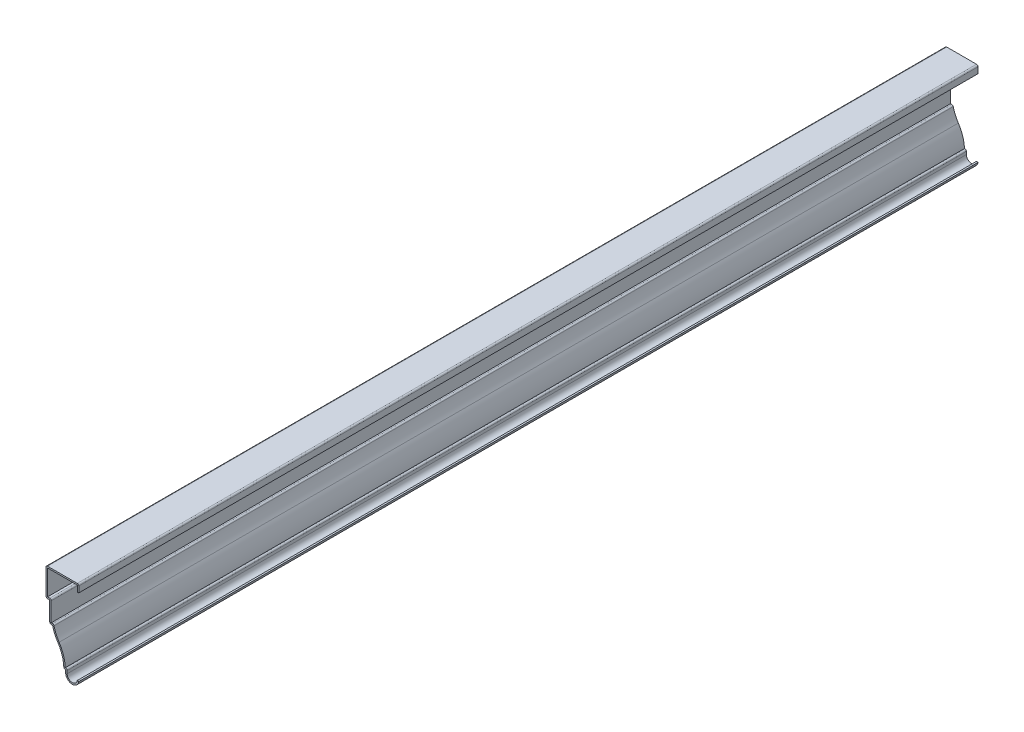
ISO-10303-21;
HEADER;
FILE_DESCRIPTION(('STEP AP214'),'2;1');
FILE_NAME('part.step','',(''),(''),'','','');
FILE_SCHEMA(('AUTOMOTIVE_DESIGN { 1 0 10303 214 1 1 1 1 }'));
ENDSEC;
DATA;
#1=APPLICATION_CONTEXT('core data for automotive mechanical design processes');
#2=APPLICATION_PROTOCOL_DEFINITION('international standard','automotive_design',2000,#1);
#3=PRODUCT_CONTEXT('',#1,'mechanical');
#4=PRODUCT('Part','Part','',(#3));
#5=PRODUCT_RELATED_PRODUCT_CATEGORY('part','',(#4));
#6=PRODUCT_DEFINITION_FORMATION('','',#4);
#7=PRODUCT_DEFINITION_CONTEXT('part definition',#1,'design');
#8=PRODUCT_DEFINITION('design','',#6,#7);
#9=PRODUCT_DEFINITION_SHAPE('','',#8);
#10=(LENGTH_UNIT() NAMED_UNIT(*) SI_UNIT(.MILLI.,.METRE.));
#11=(NAMED_UNIT(*) PLANE_ANGLE_UNIT() SI_UNIT($,.RADIAN.));
#12=(NAMED_UNIT(*) SI_UNIT($,.STERADIAN.) SOLID_ANGLE_UNIT());
#13=UNCERTAINTY_MEASURE_WITH_UNIT(LENGTH_MEASURE(1.E-05),#10,'distance_accuracy_value','');
#14=(GEOMETRIC_REPRESENTATION_CONTEXT(3) GLOBAL_UNCERTAINTY_ASSIGNED_CONTEXT((#13)) GLOBAL_UNIT_ASSIGNED_CONTEXT((#10,
#11,#12)) REPRESENTATION_CONTEXT('',''));
#15=CARTESIAN_POINT('',(0.,0.,0.));
#16=DIRECTION('',(0.,0.,1.));
#17=DIRECTION('',(1.,0.,0.));
#18=AXIS2_PLACEMENT_3D('',#15,#16,#17);
#19=CARTESIAN_POINT('',(-1.27,76.2,-762.));
#20=DIRECTION('',(-1.,0.,0.));
#21=DIRECTION('',(0.,-1.,0.));
#22=AXIS2_PLACEMENT_3D('',#19,#20,#21);
#23=PLANE('',#22);
#24=DIRECTION('',(0.,-1.,0.));
#25=VECTOR('',#24,1.);
#26=CARTESIAN_POINT('',(-1.27,76.2,0.));
#27=LINE('',#26,#25);
#28=CARTESIAN_POINT('',(-1.27,74.93,0.));
#29=VERTEX_POINT('',#28);
#30=CARTESIAN_POINT('',(-1.27,69.85,0.));
#31=VERTEX_POINT('',#30);
#32=EDGE_CURVE('E326',#29,#31,#27,.T.);
#33=ORIENTED_EDGE('',*,*,#32,.F.);
#34=DIRECTION('',(0.,0.,1.));
#35=VECTOR('',#34,1.);
#36=CARTESIAN_POINT('',(-1.27,74.93,-762.));
#37=LINE('',#36,#35);
#38=CARTESIAN_POINT('',(-1.27,74.93,-762.));
#39=VERTEX_POINT('',#38);
#40=EDGE_CURVE('E269',#39,#29,#37,.T.);
#41=ORIENTED_EDGE('',*,*,#40,.F.);
#42=DIRECTION('',(0.,-1.,0.));
#43=VECTOR('',#42,1.);
#44=CARTESIAN_POINT('',(-1.27,76.2,-762.));
#45=LINE('',#44,#43);
#46=CARTESIAN_POINT('',(-1.27,69.85,-762.));
#47=VERTEX_POINT('',#46);
#48=EDGE_CURVE('E250',#39,#47,#45,.T.);
#49=ORIENTED_EDGE('',*,*,#48,.T.);
#50=DIRECTION('',(0.,0.,1.));
#51=VECTOR('',#50,1.);
#52=CARTESIAN_POINT('',(-1.27,69.85,-762.));
#53=LINE('',#52,#51);
#54=EDGE_CURVE('E259',#47,#31,#53,.T.);
#55=ORIENTED_EDGE('',*,*,#54,.T.);
#56=EDGE_LOOP('',(#33,#41,#49,#55));
#57=FACE_BOUND('',#56,.T.);
#58=ADVANCED_FACE('F35',(#57),#23,.T.);
#59=CARTESIAN_POINT('',(-27.78125,74.93,-762.));
#60=DIRECTION('',(0.,-1.,0.));
#61=DIRECTION('',(0.,0.,-1.));
#62=AXIS2_PLACEMENT_3D('',#59,#60,#61);
#63=PLANE('',#62);
#64=DIRECTION('',(1.,0.,0.));
#65=VECTOR('',#64,1.);
#66=CARTESIAN_POINT('',(-27.78125,74.93,0.));
#67=LINE('',#66,#65);
#68=CARTESIAN_POINT('',(-26.51125,74.93,0.));
#69=VERTEX_POINT('',#68);
#70=EDGE_CURVE('E270',#69,#29,#67,.T.);
#71=ORIENTED_EDGE('',*,*,#70,.F.);
#72=DIRECTION('',(0.,0.,1.));
#73=VECTOR('',#72,1.);
#74=CARTESIAN_POINT('',(-26.51125,74.93,-762.));
#75=LINE('',#74,#73);
#76=CARTESIAN_POINT('',(-26.51125,74.93,-762.));
#77=VERTEX_POINT('',#76);
#78=EDGE_CURVE('E382',#77,#69,#75,.T.);
#79=ORIENTED_EDGE('',*,*,#78,.F.);
#80=DIRECTION('',(1.,0.,0.));
#81=VECTOR('',#80,1.);
#82=CARTESIAN_POINT('',(-27.78125,74.93,-762.));
#83=LINE('',#82,#81);
#84=EDGE_CURVE('E267',#77,#39,#83,.T.);
#85=ORIENTED_EDGE('',*,*,#84,.T.);
#86=ORIENTED_EDGE('',*,*,#40,.T.);
#87=EDGE_LOOP('',(#71,#79,#85,#86));
#88=FACE_BOUND('',#87,.T.);
#89=ADVANCED_FACE('F507',(#88),#63,.T.);
#90=CARTESIAN_POINT('',(-26.51125,52.3875,-762.));
#91=DIRECTION('',(1.,0.,0.));
#92=DIRECTION('',(0.,0.,-1.));
#93=AXIS2_PLACEMENT_3D('',#90,#91,#92);
#94=PLANE('',#93);
#95=DIRECTION('',(0.,1.,0.));
#96=VECTOR('',#95,1.);
#97=CARTESIAN_POINT('',(-26.51125,52.3875,0.));
#98=LINE('',#97,#96);
#99=CARTESIAN_POINT('',(-26.51125,53.6575,0.));
#100=VERTEX_POINT('',#99);
#101=EDGE_CURVE('E273',#100,#69,#98,.T.);
#102=ORIENTED_EDGE('',*,*,#101,.F.);
#103=DIRECTION('',(0.,0.,1.));
#104=VECTOR('',#103,1.);
#105=CARTESIAN_POINT('',(-26.51125,53.6575,-762.));
#106=LINE('',#105,#104);
#107=CARTESIAN_POINT('',(-26.51125,53.6575,-762.));
#108=VERTEX_POINT('',#107);
#109=EDGE_CURVE('E384',#108,#100,#106,.T.);
#110=ORIENTED_EDGE('',*,*,#109,.F.);
#111=DIRECTION('',(0.,1.,0.));
#112=VECTOR('',#111,1.);
#113=CARTESIAN_POINT('',(-26.51125,52.3875,-762.));
#114=LINE('',#113,#112);
#115=EDGE_CURVE('E322',#108,#77,#114,.T.);
#116=ORIENTED_EDGE('',*,*,#115,.T.);
#117=ORIENTED_EDGE('',*,*,#78,.T.);
#118=EDGE_LOOP('',(#102,#110,#116,#117));
#119=FACE_BOUND('',#118,.T.);
#120=ADVANCED_FACE('F513',(#119),#94,.T.);
#121=CARTESIAN_POINT('',(-24.60625,53.6575,-762.));
#122=DIRECTION('',(0.,1.,0.));
#123=DIRECTION('',(0.,0.,1.));
#124=AXIS2_PLACEMENT_3D('',#121,#122,#123);
#125=PLANE('',#124);
#126=DIRECTION('',(1.,0.,0.));
#127=VECTOR('',#126,1.);
#128=CARTESIAN_POINT('',(-24.60625,53.6575,0.));
#129=LINE('',#128,#127);
#130=CARTESIAN_POINT('',(-24.60625,53.6575,0.));
#131=VERTEX_POINT('',#130);
#132=EDGE_CURVE('E376',#131,#100,#129,.F.);
#133=ORIENTED_EDGE('',*,*,#132,.F.);
#134=DIRECTION('',(0.,0.,1.));
#135=VECTOR('',#134,1.);
#136=CARTESIAN_POINT('',(-24.60625,53.6575,-762.));
#137=LINE('',#136,#135);
#138=CARTESIAN_POINT('',(-24.60625,53.6575,-762.));
#139=VERTEX_POINT('',#138);
#140=EDGE_CURVE('E479',#131,#139,#137,.F.);
#141=ORIENTED_EDGE('',*,*,#140,.T.);
#142=DIRECTION('',(1.,0.,0.));
#143=VECTOR('',#142,1.);
#144=CARTESIAN_POINT('',(-24.60625,53.6575,-762.));
#145=LINE('',#144,#143);
#146=EDGE_CURVE('E320',#139,#108,#145,.F.);
#147=ORIENTED_EDGE('',*,*,#146,.T.);
#148=ORIENTED_EDGE('',*,*,#109,.T.);
#149=EDGE_LOOP('',(#133,#141,#147,#148));
#150=FACE_BOUND('',#149,.T.);
#151=ADVANCED_FACE('F516',(#150),#125,.T.);
#152=CARTESIAN_POINT('',(-23.33625,34.925,-762.));
#153=DIRECTION('',(1.,0.,0.));
#154=DIRECTION('',(0.,0.,-1.));
#155=AXIS2_PLACEMENT_3D('',#152,#153,#154);
#156=PLANE('',#155);
#157=DIRECTION('',(0.,1.,0.));
#158=VECTOR('',#157,1.);
#159=CARTESIAN_POINT('',(-23.33625,34.925,-762.));
#160=LINE('',#159,#158);
#161=CARTESIAN_POINT('',(-23.33625,36.195,-762.));
#162=VERTEX_POINT('',#161);
#163=CARTESIAN_POINT('',(-23.33625,52.3875,-762.));
#164=VERTEX_POINT('',#163);
#165=EDGE_CURVE('E317',#162,#164,#160,.T.);
#166=ORIENTED_EDGE('',*,*,#165,.T.);
#167=DIRECTION('',(0.,0.,1.));
#168=VECTOR('',#167,1.);
#169=CARTESIAN_POINT('',(-23.33625,52.3875,-762.));
#170=LINE('',#169,#168);
#171=CARTESIAN_POINT('',(-23.33625,52.3875,0.));
#172=VERTEX_POINT('',#171);
#173=EDGE_CURVE('E476',#164,#172,#170,.T.);
#174=ORIENTED_EDGE('',*,*,#173,.T.);
#175=DIRECTION('',(0.,1.,0.));
#176=VECTOR('',#175,1.);
#177=CARTESIAN_POINT('',(-23.33625,34.925,0.));
#178=LINE('',#177,#176);
#179=CARTESIAN_POINT('',(-23.33625,36.195,0.));
#180=VERTEX_POINT('',#179);
#181=EDGE_CURVE('E373',#180,#172,#178,.T.);
#182=ORIENTED_EDGE('',*,*,#181,.F.);
#183=DIRECTION('',(0.,0.,1.));
#184=VECTOR('',#183,1.);
#185=CARTESIAN_POINT('',(-23.33625,36.195,-762.));
#186=LINE('',#185,#184);
#187=EDGE_CURVE('E387',#162,#180,#186,.T.);
#188=ORIENTED_EDGE('',*,*,#187,.F.);
#189=EDGE_LOOP('',(#166,#174,#182,#188));
#190=FACE_BOUND('',#189,.T.);
#191=ADVANCED_FACE('F525',(#190),#156,.T.);
#192=CARTESIAN_POINT('',(-22.225,36.195,-762.));
#193=DIRECTION('',(0.,1.,0.));
#194=DIRECTION('',(0.,0.,1.));
#195=AXIS2_PLACEMENT_3D('',#192,#193,#194);
#196=PLANE('',#195);
#197=DIRECTION('',(1.,0.,0.));
#198=VECTOR('',#197,1.);
#199=CARTESIAN_POINT('',(-22.225,36.195,0.));
#200=LINE('',#199,#198);
#201=CARTESIAN_POINT('',(-22.225,36.195,0.));
#202=VERTEX_POINT('',#201);
#203=EDGE_CURVE('E371',#202,#180,#200,.F.);
#204=ORIENTED_EDGE('',*,*,#203,.F.);
#205=DIRECTION('',(0.,0.,1.));
#206=VECTOR('',#205,1.);
#207=CARTESIAN_POINT('',(-22.225,36.195,-762.));
#208=LINE('',#207,#206);
#209=CARTESIAN_POINT('',(-22.225,36.195,-762.));
#210=VERTEX_POINT('',#209);
#211=EDGE_CURVE('E469',#202,#210,#208,.F.);
#212=ORIENTED_EDGE('',*,*,#211,.T.);
#213=DIRECTION('',(1.,0.,0.));
#214=VECTOR('',#213,1.);
#215=CARTESIAN_POINT('',(-22.225,36.195,-762.));
#216=LINE('',#215,#214);
#217=EDGE_CURVE('E315',#210,#162,#216,.F.);
#218=ORIENTED_EDGE('',*,*,#217,.T.);
#219=ORIENTED_EDGE('',*,*,#187,.T.);
#220=EDGE_LOOP('',(#204,#212,#218,#219));
#221=FACE_BOUND('',#220,.T.);
#222=ADVANCED_FACE('F529',(#221),#196,.T.);
#223=CARTESIAN_POINT('',(9.40555247345376,42.5803128144177,-762.));
#224=DIRECTION('',(0.,0.,1.));
#225=DIRECTION('',(1.,0.,0.));
#226=AXIS2_PLACEMENT_3D('',#223,#224,#225);
#227=CYLINDRICAL_SURFACE('',#226,31.27375);
#228=CARTESIAN_POINT('',(9.40555247345376,42.5803128144177,-762.));
#229=DIRECTION('',(0.,0.,1.));
#230=DIRECTION('',(1.,0.,0.));
#231=AXIS2_PLACEMENT_3D('',#228,#229,#230);
#232=CIRCLE('',#231,31.27375);
#233=CARTESIAN_POINT('',(-16.6623116715346,25.3027580689992,-762.));
#234=VERTEX_POINT('',#233);
#235=CARTESIAN_POINT('',(-20.9906369766457,35.223743914709,-762.));
#236=VERTEX_POINT('',#235);
#237=EDGE_CURVE('E312',#234,#236,#232,.F.);
#238=ORIENTED_EDGE('',*,*,#237,.T.);
#239=DIRECTION('',(0.,0.,1.));
#240=VECTOR('',#239,1.);
#241=CARTESIAN_POINT('',(-20.9906369766457,35.223743914709,-762.));
#242=LINE('',#241,#240);
#243=CARTESIAN_POINT('',(-20.9906369766457,35.223743914709,0.));
#244=VERTEX_POINT('',#243);
#245=EDGE_CURVE('E466',#236,#244,#242,.T.);
#246=ORIENTED_EDGE('',*,*,#245,.T.);
#247=CARTESIAN_POINT('',(9.40555247345376,42.5803128144177,0.));
#248=DIRECTION('',(0.,0.,1.));
#249=DIRECTION('',(1.,0.,0.));
#250=AXIS2_PLACEMENT_3D('',#247,#248,#249);
#251=CIRCLE('',#250,31.27375);
#252=CARTESIAN_POINT('',(-16.6623116715346,25.3027580689992,0.));
#253=VERTEX_POINT('',#252);
#254=EDGE_CURVE('E368',#253,#244,#251,.F.);
#255=ORIENTED_EDGE('',*,*,#254,.F.);
#256=DIRECTION('',(0.,0.,1.));
#257=VECTOR('',#256,1.);
#258=CARTESIAN_POINT('',(-16.6623116715346,25.3027580689992,-762.));
#259=LINE('',#258,#257);
#260=EDGE_CURVE('E390',#234,#253,#259,.T.);
#261=ORIENTED_EDGE('',*,*,#260,.F.);
#262=EDGE_LOOP('',(#238,#246,#255,#261));
#263=FACE_BOUND('',#262,.T.);
#264=ADVANCED_FACE('F538',(#263),#227,.F.);
#265=CARTESIAN_POINT('',(-42.8625,7.93749999999999,-762.));
#266=DIRECTION('',(0.,0.,1.));
#267=DIRECTION('',(1.,0.,0.));
#268=AXIS2_PLACEMENT_3D('',#265,#266,#267);
#269=CYLINDRICAL_SURFACE('',#268,31.4325);
#270=CARTESIAN_POINT('',(-42.8625,7.93749999999999,0.));
#271=DIRECTION('',(0.,0.,1.));
#272=DIRECTION('',(1.,0.,0.));
#273=AXIS2_PLACEMENT_3D('',#270,#271,#272);
#274=CIRCLE('',#273,31.4325);
#275=CARTESIAN_POINT('',(-11.4556670452113,9.2075,0.));
#276=VERTEX_POINT('',#275);
#277=EDGE_CURVE('E365',#276,#253,#274,.T.);
#278=ORIENTED_EDGE('',*,*,#277,.F.);
#279=DIRECTION('',(0.,0.,1.));
#280=VECTOR('',#279,1.);
#281=CARTESIAN_POINT('',(-11.4556670452113,9.2075,-762.));
#282=LINE('',#281,#280);
#283=CARTESIAN_POINT('',(-11.4556670452113,9.2075,-762.));
#284=VERTEX_POINT('',#283);
#285=EDGE_CURVE('E392',#284,#276,#282,.T.);
#286=ORIENTED_EDGE('',*,*,#285,.F.);
#287=CARTESIAN_POINT('',(-42.8625,7.93749999999999,-762.));
#288=DIRECTION('',(0.,0.,1.));
#289=DIRECTION('',(1.,0.,0.));
#290=AXIS2_PLACEMENT_3D('',#287,#288,#289);
#291=CIRCLE('',#290,31.4325);
#292=EDGE_CURVE('E309',#284,#234,#291,.T.);
#293=ORIENTED_EDGE('',*,*,#292,.T.);
#294=ORIENTED_EDGE('',*,*,#260,.T.);
#295=EDGE_LOOP('',(#278,#286,#293,#294));
#296=FACE_BOUND('',#295,.T.);
#297=ADVANCED_FACE('F543',(#296),#269,.T.);
#298=CARTESIAN_POINT('',(-11.1125,9.2075,-762.));
#299=DIRECTION('',(0.,1.,0.));
#300=DIRECTION('',(-1.,0.,0.));
#301=AXIS2_PLACEMENT_3D('',#298,#299,#300);
#302=PLANE('',#301);
#303=DIRECTION('',(-1.,0.,0.));
#304=VECTOR('',#303,1.);
#305=CARTESIAN_POINT('',(-11.1125,9.2075,0.));
#306=LINE('',#305,#304);
#307=CARTESIAN_POINT('',(-11.1125,9.2075,0.));
#308=VERTEX_POINT('',#307);
#309=EDGE_CURVE('E363',#308,#276,#306,.T.);
#310=ORIENTED_EDGE('',*,*,#309,.F.);
#311=DIRECTION('',(0.,0.,1.));
#312=VECTOR('',#311,1.);
#313=CARTESIAN_POINT('',(-11.1125,9.2075,-762.));
#314=LINE('',#313,#312);
#315=CARTESIAN_POINT('',(-11.1125,9.2075,-762.));
#316=VERTEX_POINT('',#315);
#317=EDGE_CURVE('E459',#308,#316,#314,.F.);
#318=ORIENTED_EDGE('',*,*,#317,.T.);
#319=DIRECTION('',(-1.,0.,0.));
#320=VECTOR('',#319,1.);
#321=CARTESIAN_POINT('',(-11.1125,9.2075,-762.));
#322=LINE('',#321,#320);
#323=EDGE_CURVE('E307',#316,#284,#322,.T.);
#324=ORIENTED_EDGE('',*,*,#323,.T.);
#325=ORIENTED_EDGE('',*,*,#285,.T.);
#326=EDGE_LOOP('',(#310,#318,#324,#325));
#327=FACE_BOUND('',#326,.T.);
#328=ADVANCED_FACE('F799',(#327),#302,.T.);
#329=CARTESIAN_POINT('',(-9.8425,5.58682414127752,-762.));
#330=DIRECTION('',(1.,0.,0.));
#331=DIRECTION('',(0.,0.,-1.));
#332=AXIS2_PLACEMENT_3D('',#329,#330,#331);
#333=PLANE('',#332);
#334=DIRECTION('',(0.,1.,0.));
#335=VECTOR('',#334,1.);
#336=CARTESIAN_POINT('',(-9.8425,5.58682414127752,-762.));
#337=LINE('',#336,#335);
#338=CARTESIAN_POINT('',(-9.8425,5.58682414127752,-762.));
#339=VERTEX_POINT('',#338);
#340=CARTESIAN_POINT('',(-9.8425,7.9375,-762.));
#341=VERTEX_POINT('',#340);
#342=EDGE_CURVE('E304',#339,#341,#337,.T.);
#343=ORIENTED_EDGE('',*,*,#342,.T.);
#344=DIRECTION('',(0.,0.,1.));
#345=VECTOR('',#344,1.);
#346=CARTESIAN_POINT('',(-9.8425,7.9375,-762.));
#347=LINE('',#346,#345);
#348=CARTESIAN_POINT('',(-9.8425,7.9375,0.));
#349=VERTEX_POINT('',#348);
#350=EDGE_CURVE('E456',#341,#349,#347,.T.);
#351=ORIENTED_EDGE('',*,*,#350,.T.);
#352=DIRECTION('',(0.,1.,0.));
#353=VECTOR('',#352,1.);
#354=CARTESIAN_POINT('',(-9.8425,5.58682414127752,0.));
#355=LINE('',#354,#353);
#356=CARTESIAN_POINT('',(-9.8425,5.58682414127752,0.));
#357=VERTEX_POINT('',#356);
#358=EDGE_CURVE('E360',#357,#349,#355,.T.);
#359=ORIENTED_EDGE('',*,*,#358,.F.);
#360=DIRECTION('',(0.,0.,1.));
#361=VECTOR('',#360,1.);
#362=CARTESIAN_POINT('',(-9.8425,5.58682414127752,-762.));
#363=LINE('',#362,#361);
#364=EDGE_CURVE('E395',#339,#357,#363,.T.);
#365=ORIENTED_EDGE('',*,*,#364,.F.);
#366=EDGE_LOOP('',(#343,#351,#359,#365));
#367=FACE_BOUND('',#366,.T.);
#368=ADVANCED_FACE('F555',(#367),#333,.T.);
#369=CARTESIAN_POINT('',(-5.52567585872248,5.58682414127752,-762.));
#370=DIRECTION('',(0.,0.,1.));
#371=DIRECTION('',(1.,0.,0.));
#372=AXIS2_PLACEMENT_3D('',#369,#370,#371);
#373=CYLINDRICAL_SURFACE('',#372,4.31682414127752);
#374=CARTESIAN_POINT('',(-5.52567585872248,5.58682414127752,0.));
#375=DIRECTION('',(0.,0.,1.));
#376=DIRECTION('',(1.,0.,0.));
#377=AXIS2_PLACEMENT_3D('',#374,#375,#376);
#378=CIRCLE('',#377,4.31682414127752);
#379=CARTESIAN_POINT('',(-1.25609973808355,4.94988582653562,0.));
#380=VERTEX_POINT('',#379);
#381=EDGE_CURVE('E357',#380,#357,#378,.F.);
#382=ORIENTED_EDGE('',*,*,#381,.F.);
#383=DIRECTION('',(0.,0.,1.));
#384=VECTOR('',#383,1.);
#385=CARTESIAN_POINT('',(-1.25609973808355,4.94988582653562,-762.));
#386=LINE('',#385,#384);
#387=CARTESIAN_POINT('',(-1.25609973808355,4.94988582653562,-762.));
#388=VERTEX_POINT('',#387);
#389=EDGE_CURVE('E397',#388,#380,#386,.T.);
#390=ORIENTED_EDGE('',*,*,#389,.F.);
#391=CARTESIAN_POINT('',(-5.52567585872248,5.58682414127752,-762.));
#392=DIRECTION('',(0.,0.,1.));
#393=DIRECTION('',(1.,0.,0.));
#394=AXIS2_PLACEMENT_3D('',#391,#392,#393);
#395=CIRCLE('',#394,4.31682414127752);
#396=EDGE_CURVE('E301',#388,#339,#395,.F.);
#397=ORIENTED_EDGE('',*,*,#396,.T.);
#398=ORIENTED_EDGE('',*,*,#364,.T.);
#399=EDGE_LOOP('',(#382,#390,#397,#398));
#400=FACE_BOUND('',#399,.T.);
#401=ADVANCED_FACE('F560',(#400),#373,.F.);
#402=CARTESIAN_POINT('',(-1.25609973808355,4.94988582653562,-762.));
#403=DIRECTION('',(-0.147547894909937,-0.989054911876811,0.));
#404=DIRECTION('',(0.989054911876811,-0.147547894909937,0.));
#405=AXIS2_PLACEMENT_3D('',#402,#403,#404);
#406=PLANE('',#405);
#407=DIRECTION('',(0.989054911876811,-0.147547894909937,0.));
#408=VECTOR('',#407,1.);
#409=CARTESIAN_POINT('',(-1.25609973808355,4.94988582653562,0.));
#410=LINE('',#409,#408);
#411=CARTESIAN_POINT('',(0.,4.7625,0.));
#412=VERTEX_POINT('',#411);
#413=EDGE_CURVE('E355',#380,#412,#410,.T.);
#414=ORIENTED_EDGE('',*,*,#413,.T.);
#415=DIRECTION('',(0.,0.,1.));
#416=VECTOR('',#415,1.);
#417=CARTESIAN_POINT('',(0.,4.7625,-762.));
#418=LINE('',#417,#416);
#419=CARTESIAN_POINT('',(0.,4.7625,-762.));
#420=VERTEX_POINT('',#419);
#421=EDGE_CURVE('E399',#420,#412,#418,.T.);
#422=ORIENTED_EDGE('',*,*,#421,.F.);
#423=DIRECTION('',(0.989054911876811,-0.147547894909937,0.));
#424=VECTOR('',#423,1.);
#425=CARTESIAN_POINT('',(-1.25609973808355,4.94988582653562,-762.));
#426=LINE('',#425,#424);
#427=EDGE_CURVE('E299',#388,#420,#426,.T.);
#428=ORIENTED_EDGE('',*,*,#427,.F.);
#429=ORIENTED_EDGE('',*,*,#389,.T.);
#430=EDGE_LOOP('',(#414,#422,#428,#429));
#431=FACE_BOUND('',#430,.T.);
#432=ADVANCED_FACE('F567',(#431),#406,.F.);
#433=CARTESIAN_POINT('',(-5.52567585872248,5.58682414127752,-762.));
#434=DIRECTION('',(0.,0.,1.));
#435=DIRECTION('',(1.,0.,0.));
#436=AXIS2_PLACEMENT_3D('',#433,#434,#435);
#437=CYLINDRICAL_SURFACE('',#436,5.58682414127752);
#438=CARTESIAN_POINT('',(-5.52567585872248,5.58682414127752,0.));
#439=DIRECTION('',(0.,0.,-1.));
#440=DIRECTION('',(-1.,0.,0.));
#441=AXIS2_PLACEMENT_3D('',#438,#439,#440);
#442=CIRCLE('',#441,5.58682414127752);
#443=CARTESIAN_POINT('',(-11.1125,5.58682414127752,0.));
#444=VERTEX_POINT('',#443);
#445=EDGE_CURVE('E353',#412,#444,#442,.T.);
#446=ORIENTED_EDGE('',*,*,#445,.T.);
#447=DIRECTION('',(0.,0.,1.));
#448=VECTOR('',#447,1.);
#449=CARTESIAN_POINT('',(-11.1125,5.58682414127752,-762.));
#450=LINE('',#449,#448);
#451=CARTESIAN_POINT('',(-11.1125,5.58682414127752,-762.));
#452=VERTEX_POINT('',#451);
#453=EDGE_CURVE('E402',#452,#444,#450,.T.);
#454=ORIENTED_EDGE('',*,*,#453,.F.);
#455=CARTESIAN_POINT('',(-5.52567585872248,5.58682414127752,-762.));
#456=DIRECTION('',(0.,0.,-1.));
#457=DIRECTION('',(-1.,0.,0.));
#458=AXIS2_PLACEMENT_3D('',#455,#456,#457);
#459=CIRCLE('',#458,5.58682414127752);
#460=EDGE_CURVE('E297',#420,#452,#459,.T.);
#461=ORIENTED_EDGE('',*,*,#460,.F.);
#462=ORIENTED_EDGE('',*,*,#421,.T.);
#463=EDGE_LOOP('',(#446,#454,#461,#462));
#464=FACE_BOUND('',#463,.T.);
#465=ADVANCED_FACE('F569',(#464),#437,.T.);
#466=CARTESIAN_POINT('',(-11.1125,5.58682414127752,-762.));
#467=DIRECTION('',(1.,0.,0.));
#468=DIRECTION('',(0.,0.,-1.));
#469=AXIS2_PLACEMENT_3D('',#466,#467,#468);
#470=PLANE('',#469);
#471=DIRECTION('',(0.,1.,0.));
#472=VECTOR('',#471,1.);
#473=CARTESIAN_POINT('',(-11.1125,5.58682414127752,0.));
#474=LINE('',#473,#472);
#475=CARTESIAN_POINT('',(-11.1125,7.9375,0.));
#476=VERTEX_POINT('',#475);
#477=EDGE_CURVE('E351',#444,#476,#474,.T.);
#478=ORIENTED_EDGE('',*,*,#477,.T.);
#479=DIRECTION('',(0.,0.,1.));
#480=VECTOR('',#479,1.);
#481=CARTESIAN_POINT('',(-11.1125,7.9375,-762.));
#482=LINE('',#481,#480);
#483=CARTESIAN_POINT('',(-11.1125,7.9375,-762.));
#484=VERTEX_POINT('',#483);
#485=EDGE_CURVE('E405',#484,#476,#482,.T.);
#486=ORIENTED_EDGE('',*,*,#485,.F.);
#487=DIRECTION('',(0.,1.,0.));
#488=VECTOR('',#487,1.);
#489=CARTESIAN_POINT('',(-11.1125,5.58682414127752,-762.));
#490=LINE('',#489,#488);
#491=EDGE_CURVE('E295',#452,#484,#490,.T.);
#492=ORIENTED_EDGE('',*,*,#491,.F.);
#493=ORIENTED_EDGE('',*,*,#453,.T.);
#494=EDGE_LOOP('',(#478,#486,#492,#493));
#495=FACE_BOUND('',#494,.T.);
#496=ADVANCED_FACE('F574',(#495),#470,.F.);
#497=CARTESIAN_POINT('',(-11.1125,7.9375,-762.));
#498=DIRECTION('',(0.,1.,0.));
#499=DIRECTION('',(-1.,0.,0.));
#500=AXIS2_PLACEMENT_3D('',#497,#498,#499);
#501=PLANE('',#500);
#502=DIRECTION('',(-1.,0.,0.));
#503=VECTOR('',#502,1.);
#504=CARTESIAN_POINT('',(-11.1125,7.9375,0.));
#505=LINE('',#504,#503);
#506=CARTESIAN_POINT('',(-11.4556670452113,7.9375,0.));
#507=VERTEX_POINT('',#506);
#508=EDGE_CURVE('E348',#476,#507,#505,.T.);
#509=ORIENTED_EDGE('',*,*,#508,.T.);
#510=DIRECTION('',(0.,0.,1.));
#511=VECTOR('',#510,1.);
#512=CARTESIAN_POINT('',(-11.4556670452113,7.9375,-762.));
#513=LINE('',#512,#511);
#514=CARTESIAN_POINT('',(-11.4556670452113,7.9375,-762.));
#515=VERTEX_POINT('',#514);
#516=EDGE_CURVE('E464',#507,#515,#513,.F.);
#517=ORIENTED_EDGE('',*,*,#516,.T.);
#518=DIRECTION('',(-1.,0.,0.));
#519=VECTOR('',#518,1.);
#520=CARTESIAN_POINT('',(-11.1125,7.9375,-762.));
#521=LINE('',#520,#519);
#522=EDGE_CURVE('E292',#484,#515,#521,.T.);
#523=ORIENTED_EDGE('',*,*,#522,.F.);
#524=ORIENTED_EDGE('',*,*,#485,.T.);
#525=EDGE_LOOP('',(#509,#517,#523,#524));
#526=FACE_BOUND('',#525,.T.);
#527=ADVANCED_FACE('F756',(#526),#501,.F.);
#528=CARTESIAN_POINT('',(-42.8625,7.93749999999999,-762.));
#529=DIRECTION('',(0.,0.,1.));
#530=DIRECTION('',(1.,0.,0.));
#531=AXIS2_PLACEMENT_3D('',#528,#529,#530);
#532=CYLINDRICAL_SURFACE('',#531,30.1625);
#533=CARTESIAN_POINT('',(-42.8625,7.93749999999999,-762.));
#534=DIRECTION('',(0.,0.,1.));
#535=DIRECTION('',(1.,0.,0.));
#536=AXIS2_PLACEMENT_3D('',#533,#534,#535);
#537=CIRCLE('',#536,30.1625);
#538=CARTESIAN_POINT('',(-12.7246299928796,9.15618686868687,-762.));
#539=VERTEX_POINT('',#538);
#540=CARTESIAN_POINT('',(-17.7209051393513,24.6011314803528,-762.));
#541=VERTEX_POINT('',#540);
#542=EDGE_CURVE('E290',#539,#541,#537,.T.);
#543=ORIENTED_EDGE('',*,*,#542,.F.);
#544=DIRECTION('',(0.,0.,1.));
#545=VECTOR('',#544,1.);
#546=CARTESIAN_POINT('',(-12.7246299928796,9.15618686868687,-762.));
#547=LINE('',#546,#545);
#548=CARTESIAN_POINT('',(-12.7246299928796,9.15618686868687,0.));
#549=VERTEX_POINT('',#548);
#550=EDGE_CURVE('E461',#539,#549,#547,.T.);
#551=ORIENTED_EDGE('',*,*,#550,.T.);
#552=CARTESIAN_POINT('',(-42.8625,7.93749999999999,0.));
#553=DIRECTION('',(0.,0.,1.));
#554=DIRECTION('',(1.,0.,0.));
#555=AXIS2_PLACEMENT_3D('',#552,#553,#554);
#556=CIRCLE('',#555,30.1625);
#557=CARTESIAN_POINT('',(-17.7209051393513,24.6011314803528,0.));
#558=VERTEX_POINT('',#557);
#559=EDGE_CURVE('E346',#549,#558,#556,.T.);
#560=ORIENTED_EDGE('',*,*,#559,.T.);
#561=DIRECTION('',(0.,0.,1.));
#562=VECTOR('',#561,1.);
#563=CARTESIAN_POINT('',(-17.7209051393513,24.6011314803528,-762.));
#564=LINE('',#563,#562);
#565=EDGE_CURVE('E408',#541,#558,#564,.T.);
#566=ORIENTED_EDGE('',*,*,#565,.F.);
#567=EDGE_LOOP('',(#543,#551,#560,#566));
#568=FACE_BOUND('',#567,.T.);
#569=ADVANCED_FACE('F585',(#568),#532,.F.);
#570=CARTESIAN_POINT('',(9.40555247345376,42.5803128144177,-762.));
#571=DIRECTION('',(0.,0.,1.));
#572=DIRECTION('',(1.,0.,0.));
#573=AXIS2_PLACEMENT_3D('',#570,#571,#572);
#574=CYLINDRICAL_SURFACE('',#573,32.54375);
#575=CARTESIAN_POINT('',(9.40555247345376,42.5803128144177,0.));
#576=DIRECTION('',(0.,0.,-1.));
#577=DIRECTION('',(-1.,0.,0.));
#578=AXIS2_PLACEMENT_3D('',#575,#576,#577);
#579=CIRCLE('',#578,32.54375);
#580=CARTESIAN_POINT('',(-22.225,34.925,0.));
#581=VERTEX_POINT('',#580);
#582=EDGE_CURVE('E344',#558,#581,#579,.T.);
#583=ORIENTED_EDGE('',*,*,#582,.T.);
#584=DIRECTION('',(0.,0.,1.));
#585=VECTOR('',#584,1.);
#586=CARTESIAN_POINT('',(-22.225,34.925,-762.));
#587=LINE('',#586,#585);
#588=CARTESIAN_POINT('',(-22.225,34.925,-762.));
#589=VERTEX_POINT('',#588);
#590=EDGE_CURVE('E411',#589,#581,#587,.T.);
#591=ORIENTED_EDGE('',*,*,#590,.F.);
#592=CARTESIAN_POINT('',(9.40555247345376,42.5803128144177,-762.));
#593=DIRECTION('',(0.,0.,-1.));
#594=DIRECTION('',(-1.,0.,0.));
#595=AXIS2_PLACEMENT_3D('',#592,#593,#594);
#596=CIRCLE('',#595,32.54375);
#597=EDGE_CURVE('E288',#541,#589,#596,.T.);
#598=ORIENTED_EDGE('',*,*,#597,.F.);
#599=ORIENTED_EDGE('',*,*,#565,.T.);
#600=EDGE_LOOP('',(#583,#591,#598,#599));
#601=FACE_BOUND('',#600,.T.);
#602=ADVANCED_FACE('F592',(#601),#574,.T.);
#603=CARTESIAN_POINT('',(-22.225,34.925,-762.));
#604=DIRECTION('',(0.,1.,0.));
#605=DIRECTION('',(0.,0.,1.));
#606=AXIS2_PLACEMENT_3D('',#603,#604,#605);
#607=PLANE('',#606);
#608=DIRECTION('',(-1.,0.,0.));
#609=VECTOR('',#608,1.);
#610=CARTESIAN_POINT('',(-22.225,34.925,0.));
#611=LINE('',#610,#609);
#612=CARTESIAN_POINT('',(-23.33625,34.925,0.));
#613=VERTEX_POINT('',#612);
#614=EDGE_CURVE('E341',#581,#613,#611,.T.);
#615=ORIENTED_EDGE('',*,*,#614,.T.);
#616=DIRECTION('',(0.,0.,1.));
#617=VECTOR('',#616,1.);
#618=CARTESIAN_POINT('',(-23.33625,34.925,-762.));
#619=LINE('',#618,#617);
#620=CARTESIAN_POINT('',(-23.33625,34.925,-762.));
#621=VERTEX_POINT('',#620);
#622=EDGE_CURVE('E474',#613,#621,#619,.F.);
#623=ORIENTED_EDGE('',*,*,#622,.T.);
#624=DIRECTION('',(-1.,0.,0.));
#625=VECTOR('',#624,1.);
#626=CARTESIAN_POINT('',(-22.225,34.925,-762.));
#627=LINE('',#626,#625);
#628=EDGE_CURVE('E285',#589,#621,#627,.T.);
#629=ORIENTED_EDGE('',*,*,#628,.F.);
#630=ORIENTED_EDGE('',*,*,#590,.T.);
#631=EDGE_LOOP('',(#615,#623,#629,#630));
#632=FACE_BOUND('',#631,.T.);
#633=ADVANCED_FACE('F596',(#632),#607,.F.);
#634=CARTESIAN_POINT('',(-24.60625,34.925,-762.));
#635=DIRECTION('',(1.,0.,0.));
#636=DIRECTION('',(0.,0.,-1.));
#637=AXIS2_PLACEMENT_3D('',#634,#635,#636);
#638=PLANE('',#637);
#639=DIRECTION('',(0.,1.,0.));
#640=VECTOR('',#639,1.);
#641=CARTESIAN_POINT('',(-24.60625,34.925,-762.));
#642=LINE('',#641,#640);
#643=CARTESIAN_POINT('',(-24.60625,36.195,-762.));
#644=VERTEX_POINT('',#643);
#645=CARTESIAN_POINT('',(-24.60625,52.3875,-762.));
#646=VERTEX_POINT('',#645);
#647=EDGE_CURVE('E283',#644,#646,#642,.T.);
#648=ORIENTED_EDGE('',*,*,#647,.F.);
#649=DIRECTION('',(0.,0.,1.));
#650=VECTOR('',#649,1.);
#651=CARTESIAN_POINT('',(-24.60625,36.195,-762.));
#652=LINE('',#651,#650);
#653=CARTESIAN_POINT('',(-24.60625,36.195,0.));
#654=VERTEX_POINT('',#653);
#655=EDGE_CURVE('E471',#644,#654,#652,.T.);
#656=ORIENTED_EDGE('',*,*,#655,.T.);
#657=DIRECTION('',(0.,1.,0.));
#658=VECTOR('',#657,1.);
#659=CARTESIAN_POINT('',(-24.60625,34.925,0.));
#660=LINE('',#659,#658);
#661=CARTESIAN_POINT('',(-24.60625,52.3875,0.));
#662=VERTEX_POINT('',#661);
#663=EDGE_CURVE('E339',#654,#662,#660,.T.);
#664=ORIENTED_EDGE('',*,*,#663,.T.);
#665=DIRECTION('',(0.,0.,1.));
#666=VECTOR('',#665,1.);
#667=CARTESIAN_POINT('',(-24.60625,52.3875,-762.));
#668=LINE('',#667,#666);
#669=EDGE_CURVE('E414',#646,#662,#668,.T.);
#670=ORIENTED_EDGE('',*,*,#669,.F.);
#671=EDGE_LOOP('',(#648,#656,#664,#670));
#672=FACE_BOUND('',#671,.T.);
#673=ADVANCED_FACE('F605',(#672),#638,.F.);
#674=CARTESIAN_POINT('',(-24.60625,52.3875,-762.));
#675=DIRECTION('',(0.,1.,0.));
#676=DIRECTION('',(0.,0.,1.));
#677=AXIS2_PLACEMENT_3D('',#674,#675,#676);
#678=PLANE('',#677);
#679=DIRECTION('',(-1.,0.,0.));
#680=VECTOR('',#679,1.);
#681=CARTESIAN_POINT('',(-24.60625,52.3875,0.));
#682=LINE('',#681,#680);
#683=CARTESIAN_POINT('',(-26.51125,52.3875,0.));
#684=VERTEX_POINT('',#683);
#685=EDGE_CURVE('E336',#662,#684,#682,.T.);
#686=ORIENTED_EDGE('',*,*,#685,.T.);
#687=DIRECTION('',(0.,0.,1.));
#688=VECTOR('',#687,1.);
#689=CARTESIAN_POINT('',(-26.51125,52.3875,-762.));
#690=LINE('',#689,#688);
#691=CARTESIAN_POINT('',(-26.51125,52.3875,-762.));
#692=VERTEX_POINT('',#691);
#693=EDGE_CURVE('E11',#684,#692,#690,.F.);
#694=ORIENTED_EDGE('',*,*,#693,.T.);
#695=DIRECTION('',(-1.,0.,0.));
#696=VECTOR('',#695,1.);
#697=CARTESIAN_POINT('',(-24.60625,52.3875,-762.));
#698=LINE('',#697,#696);
#699=EDGE_CURVE('E281',#646,#692,#698,.T.);
#700=ORIENTED_EDGE('',*,*,#699,.F.);
#701=ORIENTED_EDGE('',*,*,#669,.T.);
#702=EDGE_LOOP('',(#686,#694,#700,#701));
#703=FACE_BOUND('',#702,.T.);
#704=ADVANCED_FACE('F609',(#703),#678,.F.);
#705=CARTESIAN_POINT('',(-27.78125,52.3875,-762.));
#706=DIRECTION('',(1.,0.,0.));
#707=DIRECTION('',(0.,0.,-1.));
#708=AXIS2_PLACEMENT_3D('',#705,#706,#707);
#709=PLANE('',#708);
#710=DIRECTION('',(0.,1.,0.));
#711=VECTOR('',#710,1.);
#712=CARTESIAN_POINT('',(-27.78125,52.3875,-762.));
#713=LINE('',#712,#711);
#714=CARTESIAN_POINT('',(-27.78125,53.6575,-762.));
#715=VERTEX_POINT('',#714);
#716=CARTESIAN_POINT('',(-27.78125,74.93,-762.));
#717=VERTEX_POINT('',#716);
#718=EDGE_CURVE('E279',#715,#717,#713,.T.);
#719=ORIENTED_EDGE('',*,*,#718,.F.);
#720=DIRECTION('',(0.,0.,1.));
#721=VECTOR('',#720,1.);
#722=CARTESIAN_POINT('',(-27.78125,53.6575,-762.));
#723=LINE('',#722,#721);
#724=CARTESIAN_POINT('',(-27.78125,53.6575,0.));
#725=VERTEX_POINT('',#724);
#726=EDGE_CURVE('E43',#715,#725,#723,.T.);
#727=ORIENTED_EDGE('',*,*,#726,.T.);
#728=DIRECTION('',(0.,1.,0.));
#729=VECTOR('',#728,1.);
#730=CARTESIAN_POINT('',(-27.78125,52.3875,0.));
#731=LINE('',#730,#729);
#732=CARTESIAN_POINT('',(-27.78125,74.93,0.));
#733=VERTEX_POINT('',#732);
#734=EDGE_CURVE('E334',#725,#733,#731,.T.);
#735=ORIENTED_EDGE('',*,*,#734,.T.);
#736=DIRECTION('',(0.,0.,1.));
#737=VECTOR('',#736,1.);
#738=CARTESIAN_POINT('',(-27.78125,74.93,-762.));
#739=LINE('',#738,#737);
#740=EDGE_CURVE('E50',#733,#717,#739,.F.);
#741=ORIENTED_EDGE('',*,*,#740,.T.);
#742=EDGE_LOOP('',(#719,#727,#735,#741));
#743=FACE_BOUND('',#742,.T.);
#744=ADVANCED_FACE('F484',(#743),#709,.F.);
#745=CARTESIAN_POINT('',(-27.78125,76.2,-762.));
#746=DIRECTION('',(0.,-1.,0.));
#747=DIRECTION('',(0.,0.,-1.));
#748=AXIS2_PLACEMENT_3D('',#745,#746,#747);
#749=PLANE('',#748);
#750=DIRECTION('',(1.,0.,0.));
#751=VECTOR('',#750,1.);
#752=CARTESIAN_POINT('',(-27.78125,76.2,0.));
#753=LINE('',#752,#751);
#754=CARTESIAN_POINT('',(-26.51125,76.2,0.));
#755=VERTEX_POINT('',#754);
#756=CARTESIAN_POINT('',(-1.27,76.2,0.));
#757=VERTEX_POINT('',#756);
#758=EDGE_CURVE('E331',#755,#757,#753,.T.);
#759=ORIENTED_EDGE('',*,*,#758,.T.);
#760=DIRECTION('',(0.,0.,1.));
#761=VECTOR('',#760,1.);
#762=CARTESIAN_POINT('',(-1.27,76.2,-762.));
#763=LINE('',#762,#761);
#764=CARTESIAN_POINT('',(-1.27,76.2,-762.));
#765=VERTEX_POINT('',#764);
#766=EDGE_CURVE('E439',#757,#765,#763,.F.);
#767=ORIENTED_EDGE('',*,*,#766,.T.);
#768=DIRECTION('',(1.,0.,0.));
#769=VECTOR('',#768,1.);
#770=CARTESIAN_POINT('',(-27.78125,76.2,-762.));
#771=LINE('',#770,#769);
#772=CARTESIAN_POINT('',(-26.51125,76.2,-762.));
#773=VERTEX_POINT('',#772);
#774=EDGE_CURVE('E277',#773,#765,#771,.T.);
#775=ORIENTED_EDGE('',*,*,#774,.F.);
#776=DIRECTION('',(0.,0.,1.));
#777=VECTOR('',#776,1.);
#778=CARTESIAN_POINT('',(-26.51125,76.2,-762.));
#779=LINE('',#778,#777);
#780=EDGE_CURVE('E436',#773,#755,#779,.T.);
#781=ORIENTED_EDGE('',*,*,#780,.T.);
#782=EDGE_LOOP('',(#759,#767,#775,#781));
#783=FACE_BOUND('',#782,.T.);
#784=ADVANCED_FACE('F496',(#783),#749,.F.);
#785=CARTESIAN_POINT('',(0.,76.2,-762.));
#786=DIRECTION('',(-1.,0.,0.));
#787=DIRECTION('',(0.,-1.,0.));
#788=AXIS2_PLACEMENT_3D('',#785,#786,#787);
#789=PLANE('',#788);
#790=DIRECTION('',(0.,-1.,0.));
#791=VECTOR('',#790,1.);
#792=CARTESIAN_POINT('',(0.,76.2,-762.));
#793=LINE('',#792,#791);
#794=CARTESIAN_POINT('',(0.,74.93,-762.));
#795=VERTEX_POINT('',#794);
#796=CARTESIAN_POINT('',(0.,69.85,-762.));
#797=VERTEX_POINT('',#796);
#798=EDGE_CURVE('E253',#795,#797,#793,.T.);
#799=ORIENTED_EDGE('',*,*,#798,.F.);
#800=DIRECTION('',(0.,0.,1.));
#801=VECTOR('',#800,1.);
#802=CARTESIAN_POINT('',(0.,74.93,-762.));
#803=LINE('',#802,#801);
#804=CARTESIAN_POINT('',(0.,74.93,0.));
#805=VERTEX_POINT('',#804);
#806=EDGE_CURVE('E381',#795,#805,#803,.T.);
#807=ORIENTED_EDGE('',*,*,#806,.T.);
#808=DIRECTION('',(0.,-1.,0.));
#809=VECTOR('',#808,1.);
#810=CARTESIAN_POINT('',(0.,76.2,0.));
#811=LINE('',#810,#809);
#812=CARTESIAN_POINT('',(0.,69.85,0.));
#813=VERTEX_POINT('',#812);
#814=EDGE_CURVE('E329',#805,#813,#811,.T.);
#815=ORIENTED_EDGE('',*,*,#814,.T.);
#816=DIRECTION('',(0.,0.,1.));
#817=VECTOR('',#816,1.);
#818=CARTESIAN_POINT('',(0.,69.85,-762.));
#819=LINE('',#818,#817);
#820=EDGE_CURVE('E266',#797,#813,#819,.T.);
#821=ORIENTED_EDGE('',*,*,#820,.F.);
#822=EDGE_LOOP('',(#799,#807,#815,#821));
#823=FACE_BOUND('',#822,.T.);
#824=ADVANCED_FACE('F503',(#823),#789,.F.);
#825=CARTESIAN_POINT('',(0.,69.85,-762.));
#826=DIRECTION('',(0.,1.,0.));
#827=DIRECTION('',(0.,0.,1.));
#828=AXIS2_PLACEMENT_3D('',#825,#826,#827);
#829=PLANE('',#828);
#830=DIRECTION('',(-1.,0.,0.));
#831=VECTOR('',#830,1.);
#832=CARTESIAN_POINT('',(0.,69.85,0.));
#833=LINE('',#832,#831);
#834=EDGE_CURVE('E262',#813,#31,#833,.T.);
#835=ORIENTED_EDGE('',*,*,#834,.T.);
#836=ORIENTED_EDGE('',*,*,#54,.F.);
#837=DIRECTION('',(-1.,0.,0.));
#838=VECTOR('',#837,1.);
#839=CARTESIAN_POINT('',(0.,69.85,-762.));
#840=LINE('',#839,#838);
#841=EDGE_CURVE('E244',#797,#47,#840,.T.);
#842=ORIENTED_EDGE('',*,*,#841,.F.);
#843=ORIENTED_EDGE('',*,*,#820,.T.);
#844=EDGE_LOOP('',(#835,#836,#842,#843));
#845=FACE_BOUND('',#844,.T.);
#846=ADVANCED_FACE('F260',(#845),#829,.F.);
#847=CARTESIAN_POINT('',(9.40555247345376,42.5803128144177,-762.));
#848=DIRECTION('',(0.,0.,-1.));
#849=DIRECTION('',(-1.,0.,0.));
#850=AXIS2_PLACEMENT_3D('',#847,#848,#849);
#851=PLANE('',#850);
#852=ORIENTED_EDGE('',*,*,#774,.T.);
#853=CARTESIAN_POINT('',(-1.27,74.93,-762.));
#854=DIRECTION('',(0.,0.,-1.));
#855=DIRECTION('',(-1.,0.,0.));
#856=AXIS2_PLACEMENT_3D('',#853,#854,#855);
#857=CIRCLE('',#856,1.27);
#858=EDGE_CURVE('E454',#765,#795,#857,.T.);
#859=ORIENTED_EDGE('',*,*,#858,.T.);
#860=ORIENTED_EDGE('',*,*,#798,.T.);
#861=ORIENTED_EDGE('',*,*,#841,.T.);
#862=ORIENTED_EDGE('',*,*,#48,.F.);
#863=ORIENTED_EDGE('',*,*,#84,.F.);
#864=ORIENTED_EDGE('',*,*,#115,.F.);
#865=ORIENTED_EDGE('',*,*,#146,.F.);
#866=CARTESIAN_POINT('',(-24.60625,52.3875,-762.));
#867=DIRECTION('',(0.,0.,-1.));
#868=DIRECTION('',(-1.,0.,0.));
#869=AXIS2_PLACEMENT_3D('',#866,#867,#868);
#870=CIRCLE('',#869,1.27);
#871=EDGE_CURVE('E444',#139,#164,#870,.T.);
#872=ORIENTED_EDGE('',*,*,#871,.T.);
#873=ORIENTED_EDGE('',*,*,#165,.F.);
#874=ORIENTED_EDGE('',*,*,#217,.F.);
#875=CARTESIAN_POINT('',(-22.225,34.925,-762.));
#876=DIRECTION('',(0.,0.,-1.));
#877=DIRECTION('',(-1.,0.,0.));
#878=AXIS2_PLACEMENT_3D('',#875,#876,#877);
#879=CIRCLE('',#878,1.27);
#880=EDGE_CURVE('E448',#210,#236,#879,.T.);
#881=ORIENTED_EDGE('',*,*,#880,.T.);
#882=ORIENTED_EDGE('',*,*,#237,.F.);
#883=ORIENTED_EDGE('',*,*,#292,.F.);
#884=ORIENTED_EDGE('',*,*,#323,.F.);
#885=CARTESIAN_POINT('',(-11.1125,7.9375,-762.));
#886=DIRECTION('',(0.,0.,-1.));
#887=DIRECTION('',(-1.,0.,0.));
#888=AXIS2_PLACEMENT_3D('',#885,#886,#887);
#889=CIRCLE('',#888,1.27);
#890=EDGE_CURVE('E452',#316,#341,#889,.T.);
#891=ORIENTED_EDGE('',*,*,#890,.T.);
#892=ORIENTED_EDGE('',*,*,#342,.F.);
#893=ORIENTED_EDGE('',*,*,#396,.F.);
#894=ORIENTED_EDGE('',*,*,#427,.T.);
#895=ORIENTED_EDGE('',*,*,#460,.T.);
#896=ORIENTED_EDGE('',*,*,#491,.T.);
#897=ORIENTED_EDGE('',*,*,#522,.T.);
#898=CARTESIAN_POINT('',(-11.4556670452113,9.2075,-762.));
#899=DIRECTION('',(0.,0.,-1.));
#900=DIRECTION('',(-1.,0.,0.));
#901=AXIS2_PLACEMENT_3D('',#898,#899,#900);
#902=CIRCLE('',#901,1.27);
#903=EDGE_CURVE('E450',#515,#539,#902,.T.);
#904=ORIENTED_EDGE('',*,*,#903,.T.);
#905=ORIENTED_EDGE('',*,*,#542,.T.);
#906=ORIENTED_EDGE('',*,*,#597,.T.);
#907=ORIENTED_EDGE('',*,*,#628,.T.);
#908=CARTESIAN_POINT('',(-23.33625,36.195,-762.));
#909=DIRECTION('',(0.,0.,-1.));
#910=DIRECTION('',(-1.,0.,0.));
#911=AXIS2_PLACEMENT_3D('',#908,#909,#910);
#912=CIRCLE('',#911,1.27);
#913=EDGE_CURVE('E446',#621,#644,#912,.T.);
#914=ORIENTED_EDGE('',*,*,#913,.T.);
#915=ORIENTED_EDGE('',*,*,#647,.T.);
#916=ORIENTED_EDGE('',*,*,#699,.T.);
#917=CARTESIAN_POINT('',(-26.51125,53.6575,-762.));
#918=DIRECTION('',(0.,0.,-1.));
#919=DIRECTION('',(-1.,0.,0.));
#920=AXIS2_PLACEMENT_3D('',#917,#918,#919);
#921=CIRCLE('',#920,1.27);
#922=EDGE_CURVE('E57',#692,#715,#921,.T.);
#923=ORIENTED_EDGE('',*,*,#922,.T.);
#924=ORIENTED_EDGE('',*,*,#718,.T.);
#925=CARTESIAN_POINT('',(-26.51125,74.93,-762.));
#926=DIRECTION('',(0.,0.,-1.));
#927=DIRECTION('',(-1.,0.,0.));
#928=AXIS2_PLACEMENT_3D('',#925,#926,#927);
#929=CIRCLE('',#928,1.27);
#930=EDGE_CURVE('E441',#717,#773,#929,.T.);
#931=ORIENTED_EDGE('',*,*,#930,.T.);
#932=EDGE_LOOP('',(#852,#859,#860,#861,#862,#863,#864,#865,#872,#873,#874,#881,#882,#883,#884,
#891,#892,#893,#894,#895,#896,#897,#904,#905,#906,#907,#914,#915,#916,#923,#924,#931));
#933=FACE_BOUND('',#932,.T.);
#934=ADVANCED_FACE('F247',(#933),#851,.T.);
#935=CARTESIAN_POINT('',(9.40555247345376,42.5803128144177,0.));
#936=DIRECTION('',(0.,0.,-1.));
#937=DIRECTION('',(-1.,0.,0.));
#938=AXIS2_PLACEMENT_3D('',#935,#936,#937);
#939=PLANE('',#938);
#940=ORIENTED_EDGE('',*,*,#814,.F.);
#941=CARTESIAN_POINT('',(-1.27,74.93,0.));
#942=DIRECTION('',(0.,0.,-1.));
#943=DIRECTION('',(-1.,0.,0.));
#944=AXIS2_PLACEMENT_3D('',#941,#942,#943);
#945=CIRCLE('',#944,1.27);
#946=EDGE_CURVE('E434',#805,#757,#945,.F.);
#947=ORIENTED_EDGE('',*,*,#946,.T.);
#948=ORIENTED_EDGE('',*,*,#758,.F.);
#949=CARTESIAN_POINT('',(-26.51125,74.93,0.));
#950=DIRECTION('',(0.,0.,-1.));
#951=DIRECTION('',(-1.,0.,0.));
#952=AXIS2_PLACEMENT_3D('',#949,#950,#951);
#953=CIRCLE('',#952,1.27);
#954=EDGE_CURVE('E420',#755,#733,#953,.F.);
#955=ORIENTED_EDGE('',*,*,#954,.T.);
#956=ORIENTED_EDGE('',*,*,#734,.F.);
#957=CARTESIAN_POINT('',(-26.51125,53.6575,0.));
#958=DIRECTION('',(0.,0.,-1.));
#959=DIRECTION('',(-1.,0.,0.));
#960=AXIS2_PLACEMENT_3D('',#957,#958,#959);
#961=CIRCLE('',#960,1.27);
#962=EDGE_CURVE('E422',#725,#684,#961,.F.);
#963=ORIENTED_EDGE('',*,*,#962,.T.);
#964=ORIENTED_EDGE('',*,*,#685,.F.);
#965=ORIENTED_EDGE('',*,*,#663,.F.);
#966=CARTESIAN_POINT('',(-23.33625,36.195,0.));
#967=DIRECTION('',(0.,0.,-1.));
#968=DIRECTION('',(-1.,0.,0.));
#969=AXIS2_PLACEMENT_3D('',#966,#967,#968);
#970=CIRCLE('',#969,1.27);
#971=EDGE_CURVE('E426',#654,#613,#970,.F.);
#972=ORIENTED_EDGE('',*,*,#971,.T.);
#973=ORIENTED_EDGE('',*,*,#614,.F.);
#974=ORIENTED_EDGE('',*,*,#582,.F.);
#975=ORIENTED_EDGE('',*,*,#559,.F.);
#976=CARTESIAN_POINT('',(-11.4556670452113,9.2075,0.));
#977=DIRECTION('',(0.,0.,-1.));
#978=DIRECTION('',(-1.,0.,0.));
#979=AXIS2_PLACEMENT_3D('',#976,#977,#978);
#980=CIRCLE('',#979,1.27);
#981=EDGE_CURVE('E430',#549,#507,#980,.F.);
#982=ORIENTED_EDGE('',*,*,#981,.T.);
#983=ORIENTED_EDGE('',*,*,#508,.F.);
#984=ORIENTED_EDGE('',*,*,#477,.F.);
#985=ORIENTED_EDGE('',*,*,#445,.F.);
#986=ORIENTED_EDGE('',*,*,#413,.F.);
#987=ORIENTED_EDGE('',*,*,#381,.T.);
#988=ORIENTED_EDGE('',*,*,#358,.T.);
#989=CARTESIAN_POINT('',(-11.1125,7.9375,0.));
#990=DIRECTION('',(0.,0.,-1.));
#991=DIRECTION('',(-1.,0.,0.));
#992=AXIS2_PLACEMENT_3D('',#989,#990,#991);
#993=CIRCLE('',#992,1.27);
#994=EDGE_CURVE('E432',#349,#308,#993,.F.);
#995=ORIENTED_EDGE('',*,*,#994,.T.);
#996=ORIENTED_EDGE('',*,*,#309,.T.);
#997=ORIENTED_EDGE('',*,*,#277,.T.);
#998=ORIENTED_EDGE('',*,*,#254,.T.);
#999=CARTESIAN_POINT('',(-22.225,34.925,0.));
#1000=DIRECTION('',(0.,0.,-1.));
#1001=DIRECTION('',(-1.,0.,0.));
#1002=AXIS2_PLACEMENT_3D('',#999,#1000,#1001);
#1003=CIRCLE('',#1002,1.27);
#1004=EDGE_CURVE('E428',#244,#202,#1003,.F.);
#1005=ORIENTED_EDGE('',*,*,#1004,.T.);
#1006=ORIENTED_EDGE('',*,*,#203,.T.);
#1007=ORIENTED_EDGE('',*,*,#181,.T.);
#1008=CARTESIAN_POINT('',(-24.60625,52.3875,0.));
#1009=DIRECTION('',(0.,0.,-1.));
#1010=DIRECTION('',(-1.,0.,0.));
#1011=AXIS2_PLACEMENT_3D('',#1008,#1009,#1010);
#1012=CIRCLE('',#1011,1.27);
#1013=EDGE_CURVE('E424',#172,#131,#1012,.F.);
#1014=ORIENTED_EDGE('',*,*,#1013,.T.);
#1015=ORIENTED_EDGE('',*,*,#132,.T.);
#1016=ORIENTED_EDGE('',*,*,#101,.T.);
#1017=ORIENTED_EDGE('',*,*,#70,.T.);
#1018=ORIENTED_EDGE('',*,*,#32,.T.);
#1019=ORIENTED_EDGE('',*,*,#834,.F.);
#1020=EDGE_LOOP('',(#940,#947,#948,#955,#956,#963,#964,#965,#972,#973,#974,#975,#982,#983,#984,
#985,#986,#987,#988,#995,#996,#997,#998,#1005,#1006,#1007,#1014,#1015,#1016,#1017,#1018,#1019));
#1021=FACE_BOUND('',#1020,.T.);
#1022=ADVANCED_FACE('F488',(#1021),#939,.F.);
#1023=CARTESIAN_POINT('',(-1.27,74.93,-762.));
#1024=DIRECTION('',(0.,0.,1.));
#1025=DIRECTION('',(1.,0.,0.));
#1026=AXIS2_PLACEMENT_3D('',#1023,#1024,#1025);
#1027=CYLINDRICAL_SURFACE('',#1026,1.27);
#1028=ORIENTED_EDGE('',*,*,#858,.F.);
#1029=ORIENTED_EDGE('',*,*,#766,.F.);
#1030=ORIENTED_EDGE('',*,*,#946,.F.);
#1031=ORIENTED_EDGE('',*,*,#806,.F.);
#1032=EDGE_LOOP('',(#1028,#1029,#1030,#1031));
#1033=FACE_BOUND('',#1032,.T.);
#1034=ADVANCED_FACE('F501',(#1033),#1027,.T.);
#1035=CARTESIAN_POINT('',(-11.1125,7.9375,-762.));
#1036=DIRECTION('',(0.,0.,1.));
#1037=DIRECTION('',(1.,0.,0.));
#1038=AXIS2_PLACEMENT_3D('',#1035,#1036,#1037);
#1039=CYLINDRICAL_SURFACE('',#1038,1.27);
#1040=ORIENTED_EDGE('',*,*,#890,.F.);
#1041=ORIENTED_EDGE('',*,*,#317,.F.);
#1042=ORIENTED_EDGE('',*,*,#994,.F.);
#1043=ORIENTED_EDGE('',*,*,#350,.F.);
#1044=EDGE_LOOP('',(#1040,#1041,#1042,#1043));
#1045=FACE_BOUND('',#1044,.T.);
#1046=ADVANCED_FACE('F552',(#1045),#1039,.T.);
#1047=CARTESIAN_POINT('',(-11.4556670452113,9.2075,-762.));
#1048=DIRECTION('',(0.,0.,1.));
#1049=DIRECTION('',(1.,0.,0.));
#1050=AXIS2_PLACEMENT_3D('',#1047,#1048,#1049);
#1051=CYLINDRICAL_SURFACE('',#1050,1.27);
#1052=ORIENTED_EDGE('',*,*,#903,.F.);
#1053=ORIENTED_EDGE('',*,*,#516,.F.);
#1054=ORIENTED_EDGE('',*,*,#981,.F.);
#1055=ORIENTED_EDGE('',*,*,#550,.F.);
#1056=EDGE_LOOP('',(#1052,#1053,#1054,#1055));
#1057=FACE_BOUND('',#1056,.T.);
#1058=ADVANCED_FACE('F582',(#1057),#1051,.T.);
#1059=CARTESIAN_POINT('',(-22.225,34.925,-762.));
#1060=DIRECTION('',(0.,0.,1.));
#1061=DIRECTION('',(1.,0.,0.));
#1062=AXIS2_PLACEMENT_3D('',#1059,#1060,#1061);
#1063=CYLINDRICAL_SURFACE('',#1062,1.27);
#1064=ORIENTED_EDGE('',*,*,#880,.F.);
#1065=ORIENTED_EDGE('',*,*,#211,.F.);
#1066=ORIENTED_EDGE('',*,*,#1004,.F.);
#1067=ORIENTED_EDGE('',*,*,#245,.F.);
#1068=EDGE_LOOP('',(#1064,#1065,#1066,#1067));
#1069=FACE_BOUND('',#1068,.T.);
#1070=ADVANCED_FACE('F535',(#1069),#1063,.T.);
#1071=CARTESIAN_POINT('',(-23.33625,36.195,-762.));
#1072=DIRECTION('',(0.,0.,1.));
#1073=DIRECTION('',(1.,0.,0.));
#1074=AXIS2_PLACEMENT_3D('',#1071,#1072,#1073);
#1075=CYLINDRICAL_SURFACE('',#1074,1.27);
#1076=ORIENTED_EDGE('',*,*,#913,.F.);
#1077=ORIENTED_EDGE('',*,*,#622,.F.);
#1078=ORIENTED_EDGE('',*,*,#971,.F.);
#1079=ORIENTED_EDGE('',*,*,#655,.F.);
#1080=EDGE_LOOP('',(#1076,#1077,#1078,#1079));
#1081=FACE_BOUND('',#1080,.T.);
#1082=ADVANCED_FACE('F602',(#1081),#1075,.T.);
#1083=CARTESIAN_POINT('',(-24.60625,52.3875,-762.));
#1084=DIRECTION('',(0.,0.,1.));
#1085=DIRECTION('',(1.,0.,0.));
#1086=AXIS2_PLACEMENT_3D('',#1083,#1084,#1085);
#1087=CYLINDRICAL_SURFACE('',#1086,1.27);
#1088=ORIENTED_EDGE('',*,*,#871,.F.);
#1089=ORIENTED_EDGE('',*,*,#140,.F.);
#1090=ORIENTED_EDGE('',*,*,#1013,.F.);
#1091=ORIENTED_EDGE('',*,*,#173,.F.);
#1092=EDGE_LOOP('',(#1088,#1089,#1090,#1091));
#1093=FACE_BOUND('',#1092,.T.);
#1094=ADVANCED_FACE('F519',(#1093),#1087,.T.);
#1095=CARTESIAN_POINT('',(-26.51125,53.6575,-762.));
#1096=DIRECTION('',(0.,0.,1.));
#1097=DIRECTION('',(1.,0.,0.));
#1098=AXIS2_PLACEMENT_3D('',#1095,#1096,#1097);
#1099=CYLINDRICAL_SURFACE('',#1098,1.27);
#1100=ORIENTED_EDGE('',*,*,#922,.F.);
#1101=ORIENTED_EDGE('',*,*,#693,.F.);
#1102=ORIENTED_EDGE('',*,*,#962,.F.);
#1103=ORIENTED_EDGE('',*,*,#726,.F.);
#1104=EDGE_LOOP('',(#1100,#1101,#1102,#1103));
#1105=FACE_BOUND('',#1104,.T.);
#1106=ADVANCED_FACE('F611',(#1105),#1099,.T.);
#1107=CARTESIAN_POINT('',(-26.51125,74.93,-762.));
#1108=DIRECTION('',(0.,0.,1.));
#1109=DIRECTION('',(1.,0.,0.));
#1110=AXIS2_PLACEMENT_3D('',#1107,#1108,#1109);
#1111=CYLINDRICAL_SURFACE('',#1110,1.27);
#1112=ORIENTED_EDGE('',*,*,#930,.F.);
#1113=ORIENTED_EDGE('',*,*,#740,.F.);
#1114=ORIENTED_EDGE('',*,*,#954,.F.);
#1115=ORIENTED_EDGE('',*,*,#780,.F.);
#1116=EDGE_LOOP('',(#1112,#1113,#1114,#1115));
#1117=FACE_BOUND('',#1116,.T.);
#1118=ADVANCED_FACE('F37',(#1117),#1111,.T.);
#1119=CLOSED_SHELL('',(#58,#89,#120,#151,#191,#222,#264,#297,#328,#368,#401,#432,#465,#496,#527,
#569,#602,#633,#673,#704,#744,#784,#824,#846,#934,#1022,#1034,#1046,#1058,#1070,#1082,#1094,
#1106,#1118));
#1120=MANIFOLD_SOLID_BREP('B2',#1119);
#1121=ADVANCED_BREP_SHAPE_REPRESENTATION('',(#18,#1120),#14);
#1122=SHAPE_DEFINITION_REPRESENTATION(#9,#1121);
ENDSEC;
END-ISO-10303-21;
